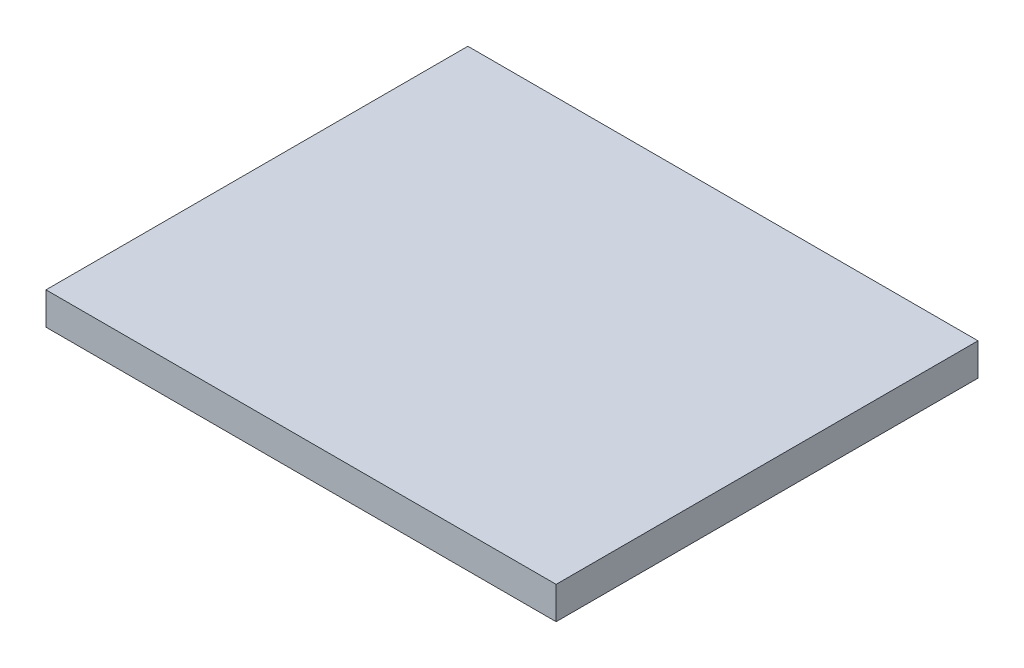
ISO-10303-21;
HEADER;
FILE_DESCRIPTION(('STEP AP214'),'2;1');
FILE_NAME('part.step','',(''),(''),'','','');
FILE_SCHEMA(('AUTOMOTIVE_DESIGN { 1 0 10303 214 1 1 1 1 }'));
ENDSEC;
DATA;
#1=APPLICATION_CONTEXT('core data for automotive mechanical design processes');
#2=APPLICATION_PROTOCOL_DEFINITION('international standard','automotive_design',2000,#1);
#3=PRODUCT_CONTEXT('',#1,'mechanical');
#4=PRODUCT('Part','Part','',(#3));
#5=PRODUCT_RELATED_PRODUCT_CATEGORY('part','',(#4));
#6=PRODUCT_DEFINITION_FORMATION('','',#4);
#7=PRODUCT_DEFINITION_CONTEXT('part definition',#1,'design');
#8=PRODUCT_DEFINITION('design','',#6,#7);
#9=PRODUCT_DEFINITION_SHAPE('','',#8);
#10=(LENGTH_UNIT() NAMED_UNIT(*) SI_UNIT(.MILLI.,.METRE.));
#11=(NAMED_UNIT(*) PLANE_ANGLE_UNIT() SI_UNIT($,.RADIAN.));
#12=(NAMED_UNIT(*) SI_UNIT($,.STERADIAN.) SOLID_ANGLE_UNIT());
#13=UNCERTAINTY_MEASURE_WITH_UNIT(LENGTH_MEASURE(1.E-05),#10,'distance_accuracy_value','');
#14=(GEOMETRIC_REPRESENTATION_CONTEXT(3) GLOBAL_UNCERTAINTY_ASSIGNED_CONTEXT((#13)) GLOBAL_UNIT_ASSIGNED_CONTEXT((#10,
#11,#12)) REPRESENTATION_CONTEXT('',''));
#15=CARTESIAN_POINT('',(0.,0.,0.));
#16=DIRECTION('',(0.,0.,1.));
#17=DIRECTION('',(1.,0.,0.));
#18=AXIS2_PLACEMENT_3D('',#15,#16,#17);
#19=CARTESIAN_POINT('',(25.,3.175,20.675));
#20=DIRECTION('',(-1.,0.,0.));
#21=DIRECTION('',(0.,0.,1.));
#22=AXIS2_PLACEMENT_3D('',#19,#20,#21);
#23=PLANE('',#22);
#24=DIRECTION('',(0.,0.,-1.));
#25=VECTOR('',#24,1.);
#26=CARTESIAN_POINT('',(25.,0.,20.675));
#27=LINE('',#26,#25);
#28=CARTESIAN_POINT('',(25.,0.,20.675));
#29=VERTEX_POINT('',#28);
#30=CARTESIAN_POINT('',(25.,0.,-20.675));
#31=VERTEX_POINT('',#30);
#32=EDGE_CURVE('E96',#29,#31,#27,.T.);
#33=ORIENTED_EDGE('',*,*,#32,.T.);
#34=DIRECTION('',(0.,-1.,0.));
#35=VECTOR('',#34,1.);
#36=CARTESIAN_POINT('',(25.,3.175,-20.675));
#37=LINE('',#36,#35);
#38=CARTESIAN_POINT('',(25.,3.175,-20.675));
#39=VERTEX_POINT('',#38);
#40=EDGE_CURVE('E11',#39,#31,#37,.T.);
#41=ORIENTED_EDGE('',*,*,#40,.F.);
#42=DIRECTION('',(0.,0.,-1.));
#43=VECTOR('',#42,1.);
#44=CARTESIAN_POINT('',(25.,3.175,20.675));
#45=LINE('',#44,#43);
#46=CARTESIAN_POINT('',(25.,3.175,20.675));
#47=VERTEX_POINT('',#46);
#48=EDGE_CURVE('E84',#47,#39,#45,.T.);
#49=ORIENTED_EDGE('',*,*,#48,.F.);
#50=DIRECTION('',(0.,-1.,0.));
#51=VECTOR('',#50,1.);
#52=CARTESIAN_POINT('',(25.,3.175,20.675));
#53=LINE('',#52,#51);
#54=EDGE_CURVE('E92',#47,#29,#53,.T.);
#55=ORIENTED_EDGE('',*,*,#54,.T.);
#56=EDGE_LOOP('',(#33,#41,#49,#55));
#57=FACE_BOUND('',#56,.T.);
#58=ADVANCED_FACE('F33',(#57),#23,.F.);
#59=CARTESIAN_POINT('',(-25.,3.175,-20.675));
#60=DIRECTION('',(0.,0.,1.));
#61=DIRECTION('',(1.,0.,0.));
#62=AXIS2_PLACEMENT_3D('',#59,#60,#61);
#63=PLANE('',#62);
#64=DIRECTION('',(-1.,0.,0.));
#65=VECTOR('',#64,1.);
#66=CARTESIAN_POINT('',(-25.,0.,-20.675));
#67=LINE('',#66,#65);
#68=CARTESIAN_POINT('',(-25.,0.,-20.675));
#69=VERTEX_POINT('',#68);
#70=EDGE_CURVE('E88',#31,#69,#67,.T.);
#71=ORIENTED_EDGE('',*,*,#70,.T.);
#72=DIRECTION('',(0.,-1.,0.));
#73=VECTOR('',#72,1.);
#74=CARTESIAN_POINT('',(-25.,3.175,-20.675));
#75=LINE('',#74,#73);
#76=CARTESIAN_POINT('',(-25.,3.175,-20.675));
#77=VERTEX_POINT('',#76);
#78=EDGE_CURVE('E41',#77,#69,#75,.T.);
#79=ORIENTED_EDGE('',*,*,#78,.F.);
#80=DIRECTION('',(-1.,0.,0.));
#81=VECTOR('',#80,1.);
#82=CARTESIAN_POINT('',(-25.,3.175,-20.675));
#83=LINE('',#82,#81);
#84=EDGE_CURVE('E79',#39,#77,#83,.T.);
#85=ORIENTED_EDGE('',*,*,#84,.F.);
#86=ORIENTED_EDGE('',*,*,#40,.T.);
#87=EDGE_LOOP('',(#71,#79,#85,#86));
#88=FACE_BOUND('',#87,.T.);
#89=ADVANCED_FACE('F87',(#88),#63,.F.);
#90=CARTESIAN_POINT('',(-25.,3.175,20.675));
#91=DIRECTION('',(1.,0.,0.));
#92=DIRECTION('',(0.,0.,-1.));
#93=AXIS2_PLACEMENT_3D('',#90,#91,#92);
#94=PLANE('',#93);
#95=DIRECTION('',(0.,0.,1.));
#96=VECTOR('',#95,1.);
#97=CARTESIAN_POINT('',(-25.,0.,20.675));
#98=LINE('',#97,#96);
#99=CARTESIAN_POINT('',(-25.,0.,20.675));
#100=VERTEX_POINT('',#99);
#101=EDGE_CURVE('E66',#69,#100,#98,.T.);
#102=ORIENTED_EDGE('',*,*,#101,.T.);
#103=DIRECTION('',(0.,-1.,0.));
#104=VECTOR('',#103,1.);
#105=CARTESIAN_POINT('',(-25.,3.175,20.675));
#106=LINE('',#105,#104);
#107=CARTESIAN_POINT('',(-25.,3.175,20.675));
#108=VERTEX_POINT('',#107);
#109=EDGE_CURVE('E89',#108,#100,#106,.T.);
#110=ORIENTED_EDGE('',*,*,#109,.F.);
#111=DIRECTION('',(0.,0.,1.));
#112=VECTOR('',#111,1.);
#113=CARTESIAN_POINT('',(-25.,3.175,20.675));
#114=LINE('',#113,#112);
#115=EDGE_CURVE('E82',#77,#108,#114,.T.);
#116=ORIENTED_EDGE('',*,*,#115,.F.);
#117=ORIENTED_EDGE('',*,*,#78,.T.);
#118=EDGE_LOOP('',(#102,#110,#116,#117));
#119=FACE_BOUND('',#118,.T.);
#120=ADVANCED_FACE('F90',(#119),#94,.F.);
#121=CARTESIAN_POINT('',(-25.,3.175,20.675));
#122=DIRECTION('',(0.,0.,-1.));
#123=DIRECTION('',(-1.,0.,0.));
#124=AXIS2_PLACEMENT_3D('',#121,#122,#123);
#125=PLANE('',#124);
#126=DIRECTION('',(1.,0.,0.));
#127=VECTOR('',#126,1.);
#128=CARTESIAN_POINT('',(-25.,0.,20.675));
#129=LINE('',#128,#127);
#130=EDGE_CURVE('E72',#100,#29,#129,.T.);
#131=ORIENTED_EDGE('',*,*,#130,.T.);
#132=ORIENTED_EDGE('',*,*,#54,.F.);
#133=DIRECTION('',(1.,0.,0.));
#134=VECTOR('',#133,1.);
#135=CARTESIAN_POINT('',(-25.,3.175,20.675));
#136=LINE('',#135,#134);
#137=EDGE_CURVE('E49',#108,#47,#136,.T.);
#138=ORIENTED_EDGE('',*,*,#137,.F.);
#139=ORIENTED_EDGE('',*,*,#109,.T.);
#140=EDGE_LOOP('',(#131,#132,#138,#139));
#141=FACE_BOUND('',#140,.T.);
#142=ADVANCED_FACE('F103',(#141),#125,.F.);
#143=CARTESIAN_POINT('',(0.,3.175,0.));
#144=DIRECTION('',(0.,-1.,0.));
#145=DIRECTION('',(0.,0.,-1.));
#146=AXIS2_PLACEMENT_3D('',#143,#144,#145);
#147=PLANE('',#146);
#148=ORIENTED_EDGE('',*,*,#48,.T.);
#149=ORIENTED_EDGE('',*,*,#84,.T.);
#150=ORIENTED_EDGE('',*,*,#115,.T.);
#151=ORIENTED_EDGE('',*,*,#137,.T.);
#152=EDGE_LOOP('',(#148,#149,#150,#151));
#153=FACE_BOUND('',#152,.T.);
#154=ADVANCED_FACE('F80',(#153),#147,.F.);
#155=CARTESIAN_POINT('',(0.,0.,0.));
#156=DIRECTION('',(0.,-1.,0.));
#157=DIRECTION('',(0.,0.,-1.));
#158=AXIS2_PLACEMENT_3D('',#155,#156,#157);
#159=PLANE('',#158);
#160=ORIENTED_EDGE('',*,*,#32,.F.);
#161=ORIENTED_EDGE('',*,*,#130,.F.);
#162=ORIENTED_EDGE('',*,*,#101,.F.);
#163=ORIENTED_EDGE('',*,*,#70,.F.);
#164=EDGE_LOOP('',(#160,#161,#162,#163));
#165=FACE_BOUND('',#164,.T.);
#166=ADVANCED_FACE('F106',(#165),#159,.T.);
#167=CLOSED_SHELL('',(#58,#89,#120,#142,#154,#166));
#168=MANIFOLD_SOLID_BREP('B2',#167);
#169=ADVANCED_BREP_SHAPE_REPRESENTATION('',(#18,#168),#14);
#170=SHAPE_DEFINITION_REPRESENTATION(#9,#169);
ENDSEC;
END-ISO-10303-21;
